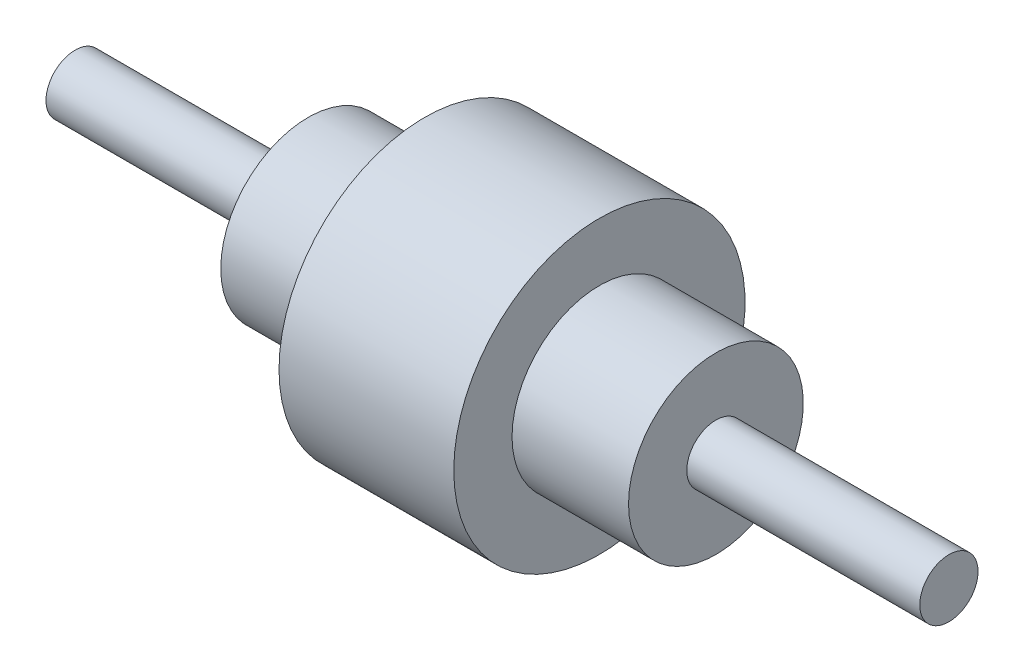
ISO-10303-21;
HEADER;
FILE_DESCRIPTION(('STEP AP214'),'2;1');
FILE_NAME('part.step','',(''),(''),'','','');
FILE_SCHEMA(('AUTOMOTIVE_DESIGN { 1 0 10303 214 1 1 1 1 }'));
ENDSEC;
DATA;
#1=APPLICATION_CONTEXT('core data for automotive mechanical design processes');
#2=APPLICATION_PROTOCOL_DEFINITION('international standard','automotive_design',2000,#1);
#3=PRODUCT_CONTEXT('',#1,'mechanical');
#4=PRODUCT('Part','Part','',(#3));
#5=PRODUCT_RELATED_PRODUCT_CATEGORY('part','',(#4));
#6=PRODUCT_DEFINITION_FORMATION('','',#4);
#7=PRODUCT_DEFINITION_CONTEXT('part definition',#1,'design');
#8=PRODUCT_DEFINITION('design','',#6,#7);
#9=PRODUCT_DEFINITION_SHAPE('','',#8);
#10=(LENGTH_UNIT() NAMED_UNIT(*) SI_UNIT(.MILLI.,.METRE.));
#11=(NAMED_UNIT(*) PLANE_ANGLE_UNIT() SI_UNIT($,.RADIAN.));
#12=(NAMED_UNIT(*) SI_UNIT($,.STERADIAN.) SOLID_ANGLE_UNIT());
#13=UNCERTAINTY_MEASURE_WITH_UNIT(LENGTH_MEASURE(1.E-05),#10,'distance_accuracy_value','');
#14=(GEOMETRIC_REPRESENTATION_CONTEXT(3) GLOBAL_UNCERTAINTY_ASSIGNED_CONTEXT((#13)) GLOBAL_UNIT_ASSIGNED_CONTEXT((#10,
#11,#12)) REPRESENTATION_CONTEXT('',''));
#15=CARTESIAN_POINT('',(0.,0.,0.));
#16=DIRECTION('',(0.,0.,1.));
#17=DIRECTION('',(1.,0.,0.));
#18=AXIS2_PLACEMENT_3D('',#15,#16,#17);
#19=CARTESIAN_POINT('',(300.,0.,0.));
#20=DIRECTION('',(1.,0.,0.));
#21=DIRECTION('',(0.,0.,-1.));
#22=AXIS2_PLACEMENT_3D('',#19,#20,#21);
#23=PLANE('',#22);
#24=CARTESIAN_POINT('',(300.,0.,0.));
#25=DIRECTION('',(-1.,0.,0.));
#26=DIRECTION('',(0.,0.,1.));
#27=AXIS2_PLACEMENT_3D('',#24,#25,#26);
#28=CIRCLE('',#27,10.);
#29=CARTESIAN_POINT('',(300.,0.,10.));
#30=VERTEX_POINT('',#29);
#31=EDGE_CURVE('E10',#30,#30,#28,.T.);
#32=ORIENTED_EDGE('',*,*,#31,.F.);
#33=EDGE_LOOP('',(#32));
#34=FACE_BOUND('',#33,.T.);
#35=ADVANCED_FACE('F33',(#34),#23,.T.);
#36=CARTESIAN_POINT('',(0.,0.,0.));
#37=DIRECTION('',(-1.,0.,0.));
#38=DIRECTION('',(0.,0.,1.));
#39=AXIS2_PLACEMENT_3D('',#36,#37,#38);
#40=CYLINDRICAL_SURFACE('',#39,10.);
#41=ORIENTED_EDGE('',*,*,#31,.T.);
#42=EDGE_LOOP('',(#41));
#43=FACE_BOUND('',#42,.T.);
#44=CARTESIAN_POINT('',(220.,0.,0.));
#45=DIRECTION('',(-1.,0.,0.));
#46=DIRECTION('',(0.,0.,1.));
#47=AXIS2_PLACEMENT_3D('',#44,#45,#46);
#48=CIRCLE('',#47,10.);
#49=CARTESIAN_POINT('',(220.,0.,10.));
#50=VERTEX_POINT('',#49);
#51=EDGE_CURVE('E39',#50,#50,#48,.T.);
#52=ORIENTED_EDGE('',*,*,#51,.F.);
#53=EDGE_LOOP('',(#52));
#54=FACE_BOUND('',#53,.T.);
#55=ADVANCED_FACE('F87',(#43,#54),#40,.T.);
#56=CARTESIAN_POINT('',(220.,0.,0.));
#57=DIRECTION('',(1.,0.,0.));
#58=DIRECTION('',(0.,0.,-1.));
#59=AXIS2_PLACEMENT_3D('',#56,#57,#58);
#60=PLANE('',#59);
#61=ORIENTED_EDGE('',*,*,#51,.T.);
#62=EDGE_LOOP('',(#61));
#63=FACE_BOUND('',#62,.T.);
#64=CARTESIAN_POINT('',(220.,0.,0.));
#65=DIRECTION('',(-1.,0.,0.));
#66=DIRECTION('',(0.,0.,1.));
#67=AXIS2_PLACEMENT_3D('',#64,#65,#66);
#68=CIRCLE('',#67,30.);
#69=CARTESIAN_POINT('',(220.,0.,30.));
#70=VERTEX_POINT('',#69);
#71=EDGE_CURVE('E43',#70,#70,#68,.T.);
#72=ORIENTED_EDGE('',*,*,#71,.F.);
#73=EDGE_LOOP('',(#72));
#74=FACE_BOUND('',#73,.T.);
#75=ADVANCED_FACE('F92',(#63,#74),#60,.T.);
#76=CARTESIAN_POINT('',(0.,0.,0.));
#77=DIRECTION('',(-1.,0.,0.));
#78=DIRECTION('',(0.,0.,1.));
#79=AXIS2_PLACEMENT_3D('',#76,#77,#78);
#80=CYLINDRICAL_SURFACE('',#79,30.);
#81=ORIENTED_EDGE('',*,*,#71,.T.);
#82=EDGE_LOOP('',(#81));
#83=FACE_BOUND('',#82,.T.);
#84=CARTESIAN_POINT('',(180.,0.,0.));
#85=DIRECTION('',(-1.,0.,0.));
#86=DIRECTION('',(0.,0.,1.));
#87=AXIS2_PLACEMENT_3D('',#84,#85,#86);
#88=CIRCLE('',#87,30.);
#89=CARTESIAN_POINT('',(180.,0.,30.));
#90=VERTEX_POINT('',#89);
#91=EDGE_CURVE('E47',#90,#90,#88,.T.);
#92=ORIENTED_EDGE('',*,*,#91,.F.);
#93=EDGE_LOOP('',(#92));
#94=FACE_BOUND('',#93,.T.);
#95=ADVANCED_FACE('F96',(#83,#94),#80,.T.);
#96=CARTESIAN_POINT('',(180.,0.,0.));
#97=DIRECTION('',(-1.,0.,0.));
#98=DIRECTION('',(0.,0.,1.));
#99=AXIS2_PLACEMENT_3D('',#96,#97,#98);
#100=PLANE('',#99);
#101=CARTESIAN_POINT('',(180.,0.,0.));
#102=DIRECTION('',(-1.,0.,0.));
#103=DIRECTION('',(0.,0.,1.));
#104=AXIS2_PLACEMENT_3D('',#101,#102,#103);
#105=CIRCLE('',#104,50.);
#106=CARTESIAN_POINT('',(180.,0.,50.));
#107=VERTEX_POINT('',#106);
#108=EDGE_CURVE('E52',#107,#107,#105,.T.);
#109=ORIENTED_EDGE('',*,*,#108,.F.);
#110=EDGE_LOOP('',(#109));
#111=FACE_BOUND('',#110,.T.);
#112=ORIENTED_EDGE('',*,*,#91,.T.);
#113=EDGE_LOOP('',(#112));
#114=FACE_BOUND('',#113,.T.);
#115=ADVANCED_FACE('F102',(#111,#114),#100,.F.);
#116=CARTESIAN_POINT('',(0.,0.,0.));
#117=DIRECTION('',(-1.,0.,0.));
#118=DIRECTION('',(0.,0.,1.));
#119=AXIS2_PLACEMENT_3D('',#116,#117,#118);
#120=CYLINDRICAL_SURFACE('',#119,50.);
#121=ORIENTED_EDGE('',*,*,#108,.T.);
#122=EDGE_LOOP('',(#121));
#123=FACE_BOUND('',#122,.T.);
#124=CARTESIAN_POINT('',(120.,0.,0.));
#125=DIRECTION('',(-1.,0.,0.));
#126=DIRECTION('',(0.,0.,1.));
#127=AXIS2_PLACEMENT_3D('',#124,#125,#126);
#128=CIRCLE('',#127,50.);
#129=CARTESIAN_POINT('',(120.,0.,50.));
#130=VERTEX_POINT('',#129);
#131=EDGE_CURVE('E55',#130,#130,#128,.T.);
#132=ORIENTED_EDGE('',*,*,#131,.F.);
#133=EDGE_LOOP('',(#132));
#134=FACE_BOUND('',#133,.T.);
#135=ADVANCED_FACE('F106',(#123,#134),#120,.T.);
#136=CARTESIAN_POINT('',(120.,0.,0.));
#137=DIRECTION('',(-1.,0.,0.));
#138=DIRECTION('',(0.,0.,1.));
#139=AXIS2_PLACEMENT_3D('',#136,#137,#138);
#140=PLANE('',#139);
#141=ORIENTED_EDGE('',*,*,#131,.T.);
#142=EDGE_LOOP('',(#141));
#143=FACE_BOUND('',#142,.T.);
#144=CARTESIAN_POINT('',(120.,0.,0.));
#145=DIRECTION('',(-1.,0.,0.));
#146=DIRECTION('',(0.,0.,1.));
#147=AXIS2_PLACEMENT_3D('',#144,#145,#146);
#148=CIRCLE('',#147,30.);
#149=CARTESIAN_POINT('',(120.,0.,30.));
#150=VERTEX_POINT('',#149);
#151=EDGE_CURVE('E58',#150,#150,#148,.T.);
#152=ORIENTED_EDGE('',*,*,#151,.F.);
#153=EDGE_LOOP('',(#152));
#154=FACE_BOUND('',#153,.T.);
#155=ADVANCED_FACE('F110',(#143,#154),#140,.T.);
#156=CARTESIAN_POINT('',(0.,0.,0.));
#157=DIRECTION('',(-1.,0.,0.));
#158=DIRECTION('',(0.,0.,1.));
#159=AXIS2_PLACEMENT_3D('',#156,#157,#158);
#160=CYLINDRICAL_SURFACE('',#159,30.);
#161=ORIENTED_EDGE('',*,*,#151,.T.);
#162=EDGE_LOOP('',(#161));
#163=FACE_BOUND('',#162,.T.);
#164=CARTESIAN_POINT('',(80.,0.,0.));
#165=DIRECTION('',(-1.,0.,0.));
#166=DIRECTION('',(0.,0.,1.));
#167=AXIS2_PLACEMENT_3D('',#164,#165,#166);
#168=CIRCLE('',#167,30.);
#169=CARTESIAN_POINT('',(80.,0.,30.));
#170=VERTEX_POINT('',#169);
#171=EDGE_CURVE('E61',#170,#170,#168,.T.);
#172=ORIENTED_EDGE('',*,*,#171,.F.);
#173=EDGE_LOOP('',(#172));
#174=FACE_BOUND('',#173,.T.);
#175=ADVANCED_FACE('F83',(#163,#174),#160,.T.);
#176=CARTESIAN_POINT('',(80.,0.,0.));
#177=DIRECTION('',(-1.,0.,0.));
#178=DIRECTION('',(0.,0.,1.));
#179=AXIS2_PLACEMENT_3D('',#176,#177,#178);
#180=PLANE('',#179);
#181=ORIENTED_EDGE('',*,*,#171,.T.);
#182=EDGE_LOOP('',(#181));
#183=FACE_BOUND('',#182,.T.);
#184=CARTESIAN_POINT('',(80.,0.,0.));
#185=DIRECTION('',(-1.,0.,0.));
#186=DIRECTION('',(0.,0.,1.));
#187=AXIS2_PLACEMENT_3D('',#184,#185,#186);
#188=CIRCLE('',#187,10.);
#189=CARTESIAN_POINT('',(80.,0.,10.));
#190=VERTEX_POINT('',#189);
#191=EDGE_CURVE('E64',#190,#190,#188,.T.);
#192=ORIENTED_EDGE('',*,*,#191,.F.);
#193=EDGE_LOOP('',(#192));
#194=FACE_BOUND('',#193,.T.);
#195=ADVANCED_FACE('F75',(#183,#194),#180,.T.);
#196=CARTESIAN_POINT('',(0.,0.,0.));
#197=DIRECTION('',(-1.,0.,0.));
#198=DIRECTION('',(0.,0.,1.));
#199=AXIS2_PLACEMENT_3D('',#196,#197,#198);
#200=CYLINDRICAL_SURFACE('',#199,10.);
#201=ORIENTED_EDGE('',*,*,#191,.T.);
#202=EDGE_LOOP('',(#201));
#203=FACE_BOUND('',#202,.T.);
#204=CARTESIAN_POINT('',(0.,0.,0.));
#205=DIRECTION('',(-1.,0.,0.));
#206=DIRECTION('',(0.,0.,1.));
#207=AXIS2_PLACEMENT_3D('',#204,#205,#206);
#208=CIRCLE('',#207,10.);
#209=CARTESIAN_POINT('',(0.,0.,10.));
#210=VERTEX_POINT('',#209);
#211=EDGE_CURVE('E67',#210,#210,#208,.T.);
#212=ORIENTED_EDGE('',*,*,#211,.F.);
#213=EDGE_LOOP('',(#212));
#214=FACE_BOUND('',#213,.T.);
#215=ADVANCED_FACE('F73',(#203,#214),#200,.T.);
#216=CARTESIAN_POINT('',(0.,0.,0.));
#217=DIRECTION('',(-1.,0.,0.));
#218=DIRECTION('',(0.,0.,1.));
#219=AXIS2_PLACEMENT_3D('',#216,#217,#218);
#220=PLANE('',#219);
#221=ORIENTED_EDGE('',*,*,#211,.T.);
#222=EDGE_LOOP('',(#221));
#223=FACE_BOUND('',#222,.T.);
#224=ADVANCED_FACE('F71',(#223),#220,.T.);
#225=CLOSED_SHELL('',(#35,#55,#75,#95,#115,#135,#155,#175,#195,#215,#224));
#226=MANIFOLD_SOLID_BREP('B2',#225);
#227=ADVANCED_BREP_SHAPE_REPRESENTATION('',(#18,#226),#14);
#228=SHAPE_DEFINITION_REPRESENTATION(#9,#227);
ENDSEC;
END-ISO-10303-21;
